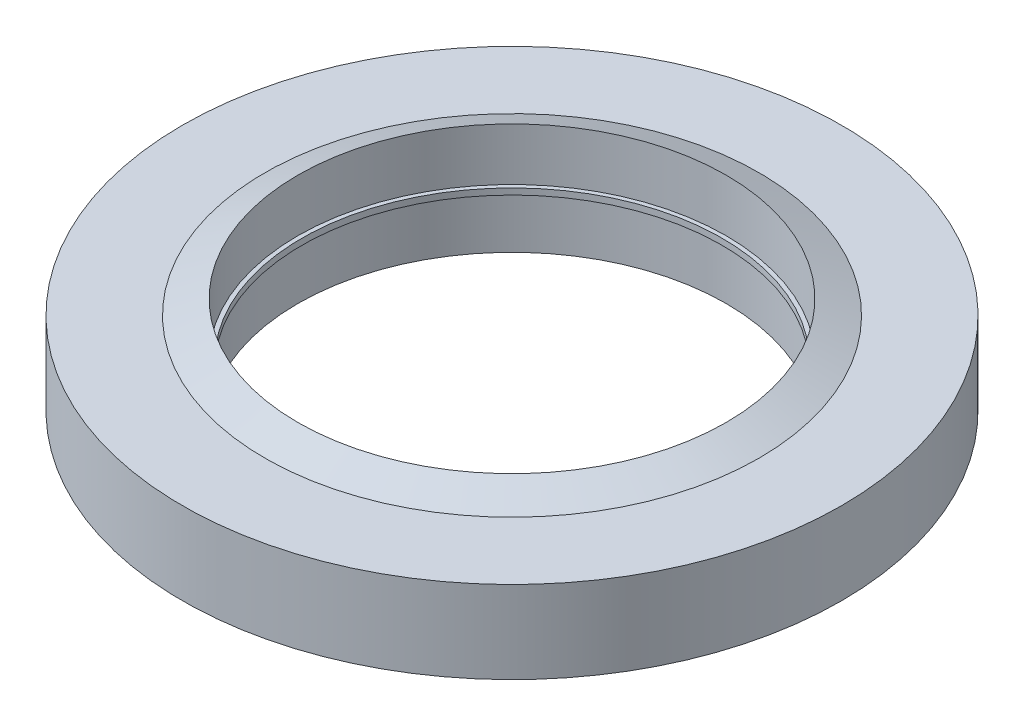
ISO-10303-21;
HEADER;
FILE_DESCRIPTION(('STEP AP214'),'2;1');
FILE_NAME('part.step','',(''),(''),'','','');
FILE_SCHEMA(('AUTOMOTIVE_DESIGN { 1 0 10303 214 1 1 1 1 }'));
ENDSEC;
DATA;
#1=APPLICATION_CONTEXT('core data for automotive mechanical design processes');
#2=APPLICATION_PROTOCOL_DEFINITION('international standard','automotive_design',2000,#1);
#3=PRODUCT_CONTEXT('',#1,'mechanical');
#4=PRODUCT('Part','Part','',(#3));
#5=PRODUCT_RELATED_PRODUCT_CATEGORY('part','',(#4));
#6=PRODUCT_DEFINITION_FORMATION('','',#4);
#7=PRODUCT_DEFINITION_CONTEXT('part definition',#1,'design');
#8=PRODUCT_DEFINITION('design','',#6,#7);
#9=PRODUCT_DEFINITION_SHAPE('','',#8);
#10=(LENGTH_UNIT() NAMED_UNIT(*) SI_UNIT(.MILLI.,.METRE.));
#11=(NAMED_UNIT(*) PLANE_ANGLE_UNIT() SI_UNIT($,.RADIAN.));
#12=(NAMED_UNIT(*) SI_UNIT($,.STERADIAN.) SOLID_ANGLE_UNIT());
#13=UNCERTAINTY_MEASURE_WITH_UNIT(LENGTH_MEASURE(1.E-05),#10,'distance_accuracy_value','');
#14=(GEOMETRIC_REPRESENTATION_CONTEXT(3) GLOBAL_UNCERTAINTY_ASSIGNED_CONTEXT((#13)) GLOBAL_UNIT_ASSIGNED_CONTEXT((#10,
#11,#12)) REPRESENTATION_CONTEXT('',''));
#15=CARTESIAN_POINT('',(0.,0.,0.));
#16=DIRECTION('',(0.,0.,1.));
#17=DIRECTION('',(1.,0.,0.));
#18=AXIS2_PLACEMENT_3D('',#15,#16,#17);
#19=CARTESIAN_POINT('',(0.,0.075,0.));
#20=DIRECTION('',(0.,-1.,0.));
#21=DIRECTION('',(1.,0.,0.));
#22=AXIS2_PLACEMENT_3D('',#19,#20,#21);
#23=PLANE('',#22);
#24=CARTESIAN_POINT('',(0.,0.0749999999999991,0.));
#25=DIRECTION('',(0.,-1.,0.));
#26=DIRECTION('',(1.,0.,0.));
#27=AXIS2_PLACEMENT_3D('',#24,#25,#26);
#28=CIRCLE('',#27,5.1);
#29=CARTESIAN_POINT('',(5.1,0.0749999999999982,0.));
#30=VERTEX_POINT('',#29);
#31=EDGE_CURVE('E44',#30,#30,#28,.T.);
#32=ORIENTED_EDGE('',*,*,#31,.T.);
#33=EDGE_LOOP('',(#32));
#34=FACE_BOUND('',#33,.T.);
#35=CARTESIAN_POINT('',(0.,0.0750000000000008,0.));
#36=DIRECTION('',(0.,-1.,0.));
#37=DIRECTION('',(1.,0.,0.));
#38=AXIS2_PLACEMENT_3D('',#35,#36,#37);
#39=CIRCLE('',#38,5.2);
#40=CARTESIAN_POINT('',(5.2,0.0749999999999999,0.));
#41=VERTEX_POINT('',#40);
#42=EDGE_CURVE('E18',#41,#41,#39,.F.);
#43=ORIENTED_EDGE('',*,*,#42,.T.);
#44=EDGE_LOOP('',(#43));
#45=FACE_BOUND('',#44,.T.);
#46=ADVANCED_FACE('F15',(#34,#45),#23,.F.);
#47=CARTESIAN_POINT('',(0.,1.485,0.));
#48=DIRECTION('',(0.,-1.,0.));
#49=DIRECTION('',(1.,0.,0.));
#50=AXIS2_PLACEMENT_3D('',#47,#48,#49);
#51=CYLINDRICAL_SURFACE('',#50,5.2);
#52=ORIENTED_EDGE('',*,*,#42,.F.);
#53=EDGE_LOOP('',(#52));
#54=FACE_BOUND('',#53,.T.);
#55=CARTESIAN_POINT('',(0.,1.35000000000218,0.));
#56=DIRECTION('',(0.,-1.,0.));
#57=DIRECTION('',(0.,0.,1.));
#58=AXIS2_PLACEMENT_3D('',#55,#56,#57);
#59=CIRCLE('',#58,5.20000000000209);
#60=CARTESIAN_POINT('',(0.,1.35000000000218,5.20000000000209));
#61=VERTEX_POINT('',#60);
#62=EDGE_CURVE('E30',#61,#61,#59,.T.);
#63=ORIENTED_EDGE('',*,*,#62,.F.);
#64=EDGE_LOOP('',(#63));
#65=FACE_BOUND('',#64,.T.);
#66=ADVANCED_FACE('F53',(#54,#65),#51,.F.);
#67=CARTESIAN_POINT('',(0.,1.485,0.));
#68=DIRECTION('',(0.,-1.,0.));
#69=DIRECTION('',(1.,0.,0.));
#70=AXIS2_PLACEMENT_3D('',#67,#68,#69);
#71=CYLINDRICAL_SURFACE('',#70,5.1);
#72=CARTESIAN_POINT('',(0.,-0.0749999999999991,0.));
#73=DIRECTION('',(0.,-1.,0.));
#74=DIRECTION('',(1.,0.,0.));
#75=AXIS2_PLACEMENT_3D('',#72,#73,#74);
#76=CIRCLE('',#75,5.1);
#77=CARTESIAN_POINT('',(5.1,-0.0750000000000001,0.));
#78=VERTEX_POINT('',#77);
#79=EDGE_CURVE('E42',#78,#78,#76,.F.);
#80=ORIENTED_EDGE('',*,*,#79,.F.);
#81=EDGE_LOOP('',(#80));
#82=FACE_BOUND('',#81,.T.);
#83=ORIENTED_EDGE('',*,*,#31,.F.);
#84=EDGE_LOOP('',(#83));
#85=FACE_BOUND('',#84,.T.);
#86=ADVANCED_FACE('F56',(#82,#85),#71,.F.);
#87=CARTESIAN_POINT('',(0.,1.00000000009004,0.));
#88=DIRECTION('',(0.,-1.,0.));
#89=DIRECTION('',(1.,0.,0.));
#90=AXIS2_PLACEMENT_3D('',#87,#88,#89);
#91=CONICAL_SURFACE('',#90,5.99999999980128,1.15838588515651);
#92=ORIENTED_EDGE('',*,*,#62,.T.);
#93=EDGE_LOOP('',(#92));
#94=FACE_BOUND('',#93,.T.);
#95=CARTESIAN_POINT('',(0.,0.999999999990564,0.));
#96=DIRECTION('',(0.,-1.,0.));
#97=DIRECTION('',(1.,0.,0.));
#98=AXIS2_PLACEMENT_3D('',#95,#96,#97);
#99=CIRCLE('',#98,6.00000000002865);
#100=CARTESIAN_POINT('',(6.00000000002865,0.999999999990563,0.));
#101=VERTEX_POINT('',#100);
#102=EDGE_CURVE('E39',#101,#101,#99,.F.);
#103=ORIENTED_EDGE('',*,*,#102,.T.);
#104=EDGE_LOOP('',(#103));
#105=FACE_BOUND('',#104,.T.);
#106=ADVANCED_FACE('F59',(#94,#105),#91,.T.);
#107=CARTESIAN_POINT('',(0.,-0.075,0.));
#108=DIRECTION('',(0.,-1.,0.));
#109=DIRECTION('',(1.,0.,0.));
#110=AXIS2_PLACEMENT_3D('',#107,#108,#109);
#111=PLANE('',#110);
#112=ORIENTED_EDGE('',*,*,#79,.T.);
#113=EDGE_LOOP('',(#112));
#114=FACE_BOUND('',#113,.T.);
#115=CARTESIAN_POINT('',(0.,-0.0750000000000008,0.));
#116=DIRECTION('',(0.,-1.,0.));
#117=DIRECTION('',(1.,0.,0.));
#118=AXIS2_PLACEMENT_3D('',#115,#116,#117);
#119=CIRCLE('',#118,5.2);
#120=CARTESIAN_POINT('',(5.2,-0.0750000000000018,0.));
#121=VERTEX_POINT('',#120);
#122=EDGE_CURVE('E36',#121,#121,#119,.T.);
#123=ORIENTED_EDGE('',*,*,#122,.T.);
#124=EDGE_LOOP('',(#123));
#125=FACE_BOUND('',#124,.T.);
#126=ADVANCED_FACE('F62',(#114,#125),#111,.T.);
#127=CARTESIAN_POINT('',(0.,1.,0.));
#128=DIRECTION('',(0.,-1.,0.));
#129=DIRECTION('',(1.,0.,0.));
#130=AXIS2_PLACEMENT_3D('',#127,#128,#129);
#131=PLANE('',#130);
#132=ORIENTED_EDGE('',*,*,#102,.F.);
#133=EDGE_LOOP('',(#132));
#134=FACE_BOUND('',#133,.T.);
#135=CARTESIAN_POINT('',(0.,1.,0.));
#136=DIRECTION('',(0.,-1.,0.));
#137=DIRECTION('',(1.,0.,0.));
#138=AXIS2_PLACEMENT_3D('',#135,#136,#137);
#139=CIRCLE('',#138,8.);
#140=CARTESIAN_POINT('',(8.,1.,0.));
#141=VERTEX_POINT('',#140);
#142=EDGE_CURVE('E33',#141,#141,#139,.T.);
#143=ORIENTED_EDGE('',*,*,#142,.F.);
#144=EDGE_LOOP('',(#143));
#145=FACE_BOUND('',#144,.T.);
#146=ADVANCED_FACE('F66',(#134,#145),#131,.F.);
#147=CARTESIAN_POINT('',(0.,1.485,0.));
#148=DIRECTION('',(0.,-1.,0.));
#149=DIRECTION('',(1.,0.,0.));
#150=AXIS2_PLACEMENT_3D('',#147,#148,#149);
#151=CYLINDRICAL_SURFACE('',#150,5.2);
#152=CARTESIAN_POINT('',(0.,-1.35000000000218,0.));
#153=DIRECTION('',(0.,1.,0.));
#154=DIRECTION('',(0.,0.,1.));
#155=AXIS2_PLACEMENT_3D('',#152,#153,#154);
#156=CIRCLE('',#155,5.20000000000209);
#157=CARTESIAN_POINT('',(0.,-1.35000000000218,5.20000000000209));
#158=VERTEX_POINT('',#157);
#159=EDGE_CURVE('E27',#158,#158,#156,.T.);
#160=ORIENTED_EDGE('',*,*,#159,.F.);
#161=EDGE_LOOP('',(#160));
#162=FACE_BOUND('',#161,.T.);
#163=ORIENTED_EDGE('',*,*,#122,.F.);
#164=EDGE_LOOP('',(#163));
#165=FACE_BOUND('',#164,.T.);
#166=ADVANCED_FACE('F69',(#162,#165),#151,.F.);
#167=CARTESIAN_POINT('',(0.,1.485,0.));
#168=DIRECTION('',(0.,-1.,0.));
#169=DIRECTION('',(1.,0.,0.));
#170=AXIS2_PLACEMENT_3D('',#167,#168,#169);
#171=CYLINDRICAL_SURFACE('',#170,8.);
#172=CARTESIAN_POINT('',(0.,-0.999999999999999,0.));
#173=DIRECTION('',(0.,-1.,0.));
#174=DIRECTION('',(1.,0.,0.));
#175=AXIS2_PLACEMENT_3D('',#172,#173,#174);
#176=CIRCLE('',#175,8.);
#177=CARTESIAN_POINT('',(8.,-1.,0.));
#178=VERTEX_POINT('',#177);
#179=EDGE_CURVE('E22',#178,#178,#176,.T.);
#180=ORIENTED_EDGE('',*,*,#179,.F.);
#181=EDGE_LOOP('',(#180));
#182=FACE_BOUND('',#181,.T.);
#183=ORIENTED_EDGE('',*,*,#142,.T.);
#184=EDGE_LOOP('',(#183));
#185=FACE_BOUND('',#184,.T.);
#186=ADVANCED_FACE('F73',(#182,#185),#171,.T.);
#187=CARTESIAN_POINT('',(0.,-1.00000000009004,0.));
#188=DIRECTION('',(0.,1.,0.));
#189=DIRECTION('',(-1.,0.,0.));
#190=AXIS2_PLACEMENT_3D('',#187,#188,#189);
#191=CONICAL_SURFACE('',#190,5.99999999980128,1.15838588515651);
#192=CARTESIAN_POINT('',(0.,-0.999999999990564,0.));
#193=DIRECTION('',(0.,1.,0.));
#194=DIRECTION('',(-1.,0.,0.));
#195=AXIS2_PLACEMENT_3D('',#192,#193,#194);
#196=CIRCLE('',#195,6.00000000002865);
#197=CARTESIAN_POINT('',(-6.00000000002865,-0.999999999990563,0.));
#198=VERTEX_POINT('',#197);
#199=EDGE_CURVE('E10',#198,#198,#196,.T.);
#200=ORIENTED_EDGE('',*,*,#199,.F.);
#201=EDGE_LOOP('',(#200));
#202=FACE_BOUND('',#201,.T.);
#203=ORIENTED_EDGE('',*,*,#159,.T.);
#204=EDGE_LOOP('',(#203));
#205=FACE_BOUND('',#204,.T.);
#206=ADVANCED_FACE('F75',(#202,#205),#191,.T.);
#207=CARTESIAN_POINT('',(0.,-1.,0.));
#208=DIRECTION('',(0.,-1.,0.));
#209=DIRECTION('',(1.,0.,0.));
#210=AXIS2_PLACEMENT_3D('',#207,#208,#209);
#211=PLANE('',#210);
#212=ORIENTED_EDGE('',*,*,#199,.T.);
#213=EDGE_LOOP('',(#212));
#214=FACE_BOUND('',#213,.T.);
#215=ORIENTED_EDGE('',*,*,#179,.T.);
#216=EDGE_LOOP('',(#215));
#217=FACE_BOUND('',#216,.T.);
#218=ADVANCED_FACE('F83',(#214,#217),#211,.T.);
#219=CLOSED_SHELL('',(#46,#66,#86,#106,#126,#146,#166,#186,#206,#218));
#220=MANIFOLD_SOLID_BREP('B1',#219);
#221=ADVANCED_BREP_SHAPE_REPRESENTATION('',(#18,#220),#14);
#222=SHAPE_DEFINITION_REPRESENTATION(#9,#221);
ENDSEC;
END-ISO-10303-21;
